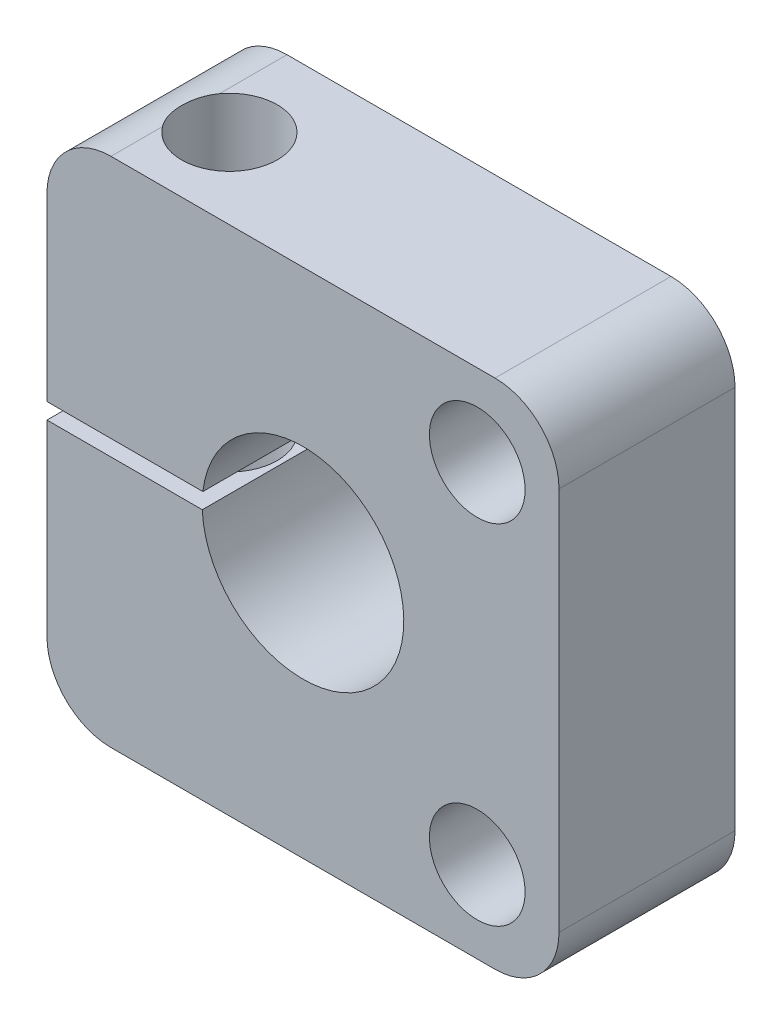
ISO-10303-21;
HEADER;
FILE_DESCRIPTION(('STEP AP214'),'2;1');
FILE_NAME('part.step','',(''),(''),'','','');
FILE_SCHEMA(('AUTOMOTIVE_DESIGN { 1 0 10303 214 1 1 1 1 }'));
ENDSEC;
DATA;
#1=APPLICATION_CONTEXT('core data for automotive mechanical design processes');
#2=APPLICATION_PROTOCOL_DEFINITION('international standard','automotive_design',2000,#1);
#3=PRODUCT_CONTEXT('',#1,'mechanical');
#4=PRODUCT('Part','Part','',(#3));
#5=PRODUCT_RELATED_PRODUCT_CATEGORY('part','',(#4));
#6=PRODUCT_DEFINITION_FORMATION('','',#4);
#7=PRODUCT_DEFINITION_CONTEXT('part definition',#1,'design');
#8=PRODUCT_DEFINITION('design','',#6,#7);
#9=PRODUCT_DEFINITION_SHAPE('','',#8);
#10=(LENGTH_UNIT() NAMED_UNIT(*) SI_UNIT(.MILLI.,.METRE.));
#11=(NAMED_UNIT(*) PLANE_ANGLE_UNIT() SI_UNIT($,.RADIAN.));
#12=(NAMED_UNIT(*) SI_UNIT($,.STERADIAN.) SOLID_ANGLE_UNIT());
#13=UNCERTAINTY_MEASURE_WITH_UNIT(LENGTH_MEASURE(1.E-05),#10,'distance_accuracy_value','');
#14=(GEOMETRIC_REPRESENTATION_CONTEXT(3) GLOBAL_UNCERTAINTY_ASSIGNED_CONTEXT((#13)) GLOBAL_UNIT_ASSIGNED_CONTEXT((#10,
#11,#12)) REPRESENTATION_CONTEXT('',''));
#15=CARTESIAN_POINT('',(0.,0.,0.));
#16=DIRECTION('',(0.,0.,1.));
#17=DIRECTION('',(1.,0.,0.));
#18=AXIS2_PLACEMENT_3D('',#15,#16,#17);
#19=CARTESIAN_POINT('',(-10.16,10.16,6.985));
#20=DIRECTION('',(1.,0.,0.));
#21=DIRECTION('',(0.,1.,0.));
#22=AXIS2_PLACEMENT_3D('',#19,#20,#21);
#23=PLANE('',#22);
#24=DIRECTION('',(0.,-1.,0.));
#25=VECTOR('',#24,1.);
#26=CARTESIAN_POINT('',(-10.16,10.16,0.));
#27=LINE('',#26,#25);
#28=CARTESIAN_POINT('',(-10.16,-0.173197844795916,0.));
#29=VERTEX_POINT('',#28);
#30=CARTESIAN_POINT('',(-10.16,-7.62,0.));
#31=VERTEX_POINT('',#30);
#32=EDGE_CURVE('E240',#29,#31,#27,.T.);
#33=ORIENTED_EDGE('',*,*,#32,.T.);
#34=DIRECTION('',(0.,0.,-1.));
#35=VECTOR('',#34,1.);
#36=CARTESIAN_POINT('',(-10.16,-7.62,6.985));
#37=LINE('',#36,#35);
#38=CARTESIAN_POINT('',(-10.16,-7.62,6.985));
#39=VERTEX_POINT('',#38);
#40=EDGE_CURVE('E173',#31,#39,#37,.F.);
#41=ORIENTED_EDGE('',*,*,#40,.T.);
#42=DIRECTION('',(0.,-1.,0.));
#43=VECTOR('',#42,1.);
#44=CARTESIAN_POINT('',(-10.16,10.16,6.985));
#45=LINE('',#44,#43);
#46=CARTESIAN_POINT('',(-10.16,-0.173197844795916,6.985));
#47=VERTEX_POINT('',#46);
#48=EDGE_CURVE('E228',#47,#39,#45,.T.);
#49=ORIENTED_EDGE('',*,*,#48,.F.);
#50=DIRECTION('',(0.,0.,-1.));
#51=VECTOR('',#50,1.);
#52=CARTESIAN_POINT('',(-10.16,-0.173197844795915,6.985));
#53=LINE('',#52,#51);
#54=EDGE_CURVE('E217',#47,#29,#53,.T.);
#55=ORIENTED_EDGE('',*,*,#54,.T.);
#56=EDGE_LOOP('',(#33,#41,#49,#55));
#57=FACE_BOUND('',#56,.T.);
#58=ADVANCED_FACE('F36',(#57),#23,.F.);
#59=CARTESIAN_POINT('',(10.16,10.16,6.985));
#60=DIRECTION('',(-1.,0.,0.));
#61=DIRECTION('',(0.,-1.,0.));
#62=AXIS2_PLACEMENT_3D('',#59,#60,#61);
#63=PLANE('',#62);
#64=DIRECTION('',(0.,1.,0.));
#65=VECTOR('',#64,1.);
#66=CARTESIAN_POINT('',(10.16,10.16,6.985));
#67=LINE('',#66,#65);
#68=CARTESIAN_POINT('',(10.16,-7.62,6.985));
#69=VERTEX_POINT('',#68);
#70=CARTESIAN_POINT('',(10.16,7.62,6.985));
#71=VERTEX_POINT('',#70);
#72=EDGE_CURVE('E221',#69,#71,#67,.T.);
#73=ORIENTED_EDGE('',*,*,#72,.F.);
#74=DIRECTION('',(0.,0.,-1.));
#75=VECTOR('',#74,1.);
#76=CARTESIAN_POINT('',(10.16,-7.62,6.985));
#77=LINE('',#76,#75);
#78=CARTESIAN_POINT('',(10.16,-7.62,0.));
#79=VERTEX_POINT('',#78);
#80=EDGE_CURVE('E247',#69,#79,#77,.T.);
#81=ORIENTED_EDGE('',*,*,#80,.T.);
#82=DIRECTION('',(0.,1.,0.));
#83=VECTOR('',#82,1.);
#84=CARTESIAN_POINT('',(10.16,10.16,0.));
#85=LINE('',#84,#83);
#86=CARTESIAN_POINT('',(10.16,7.62,0.));
#87=VERTEX_POINT('',#86);
#88=EDGE_CURVE('E220',#79,#87,#85,.T.);
#89=ORIENTED_EDGE('',*,*,#88,.T.);
#90=DIRECTION('',(0.,0.,-1.));
#91=VECTOR('',#90,1.);
#92=CARTESIAN_POINT('',(10.16,7.62,6.985));
#93=LINE('',#92,#91);
#94=EDGE_CURVE('E245',#87,#71,#93,.F.);
#95=ORIENTED_EDGE('',*,*,#94,.T.);
#96=EDGE_LOOP('',(#73,#81,#89,#95));
#97=FACE_BOUND('',#96,.T.);
#98=ADVANCED_FACE('F271',(#97),#63,.F.);
#99=CARTESIAN_POINT('',(-10.16,10.16,6.985));
#100=DIRECTION('',(0.,-1.,0.));
#101=DIRECTION('',(0.,0.,-1.));
#102=AXIS2_PLACEMENT_3D('',#99,#100,#101);
#103=PLANE('',#102);
#104=DIRECTION('',(0.,0.,-1.));
#105=VECTOR('',#104,1.);
#106=CARTESIAN_POINT('',(-7.62,10.16,6.985));
#107=LINE('',#106,#105);
#108=CARTESIAN_POINT('',(-7.62,10.16,0.));
#109=VERTEX_POINT('',#108);
#110=CARTESIAN_POINT('',(-7.62,10.16,2.67761498486603));
#111=VERTEX_POINT('',#110);
#112=EDGE_CURVE('E176',#109,#111,#107,.F.);
#113=ORIENTED_EDGE('',*,*,#112,.T.);
#114=CARTESIAN_POINT('',(-6.096,10.16,3.81));
#115=DIRECTION('',(0.,1.,0.));
#116=DIRECTION('',(0.,0.,1.));
#117=AXIS2_PLACEMENT_3D('',#114,#115,#116);
#118=CIRCLE('',#117,1.89864999999999);
#119=CARTESIAN_POINT('',(-7.62,10.16,4.94238501513397));
#120=VERTEX_POINT('',#119);
#121=EDGE_CURVE('E56',#120,#111,#118,.T.);
#122=ORIENTED_EDGE('',*,*,#121,.F.);
#123=CARTESIAN_POINT('',(-7.62,10.16,6.985));
#124=VERTEX_POINT('',#123);
#125=EDGE_CURVE('E175',#120,#124,#107,.F.);
#126=ORIENTED_EDGE('',*,*,#125,.T.);
#127=DIRECTION('',(-1.,0.,0.));
#128=VECTOR('',#127,1.);
#129=CARTESIAN_POINT('',(-10.16,10.16,6.985));
#130=LINE('',#129,#128);
#131=CARTESIAN_POINT('',(7.62,10.16,6.985));
#132=VERTEX_POINT('',#131);
#133=EDGE_CURVE('E224',#132,#124,#130,.T.);
#134=ORIENTED_EDGE('',*,*,#133,.F.);
#135=DIRECTION('',(0.,0.,-1.));
#136=VECTOR('',#135,1.);
#137=CARTESIAN_POINT('',(7.62,10.16,6.985));
#138=LINE('',#137,#136);
#139=CARTESIAN_POINT('',(7.62,10.16,0.));
#140=VERTEX_POINT('',#139);
#141=EDGE_CURVE('E179',#132,#140,#138,.T.);
#142=ORIENTED_EDGE('',*,*,#141,.T.);
#143=DIRECTION('',(-1.,0.,0.));
#144=VECTOR('',#143,1.);
#145=CARTESIAN_POINT('',(-10.16,10.16,0.));
#146=LINE('',#145,#144);
#147=EDGE_CURVE('E237',#140,#109,#146,.T.);
#148=ORIENTED_EDGE('',*,*,#147,.T.);
#149=EDGE_LOOP('',(#113,#122,#126,#134,#142,#148));
#150=FACE_BOUND('',#149,.T.);
#151=ADVANCED_FACE('F280',(#150),#103,.F.);
#152=CARTESIAN_POINT('',(-10.16,7.62,6.985));
#153=VERTEX_POINT('',#152);
#154=CARTESIAN_POINT('',(-10.16,0.461802155204082,6.985));
#155=VERTEX_POINT('',#154);
#156=EDGE_CURVE('E229',#153,#155,#45,.T.);
#157=ORIENTED_EDGE('',*,*,#156,.F.);
#158=DIRECTION('',(0.,0.,-1.));
#159=VECTOR('',#158,1.);
#160=CARTESIAN_POINT('',(-10.16,7.62,6.985));
#161=LINE('',#160,#159);
#162=CARTESIAN_POINT('',(-10.16,7.62,0.));
#163=VERTEX_POINT('',#162);
#164=EDGE_CURVE('E182',#153,#163,#161,.T.);
#165=ORIENTED_EDGE('',*,*,#164,.T.);
#166=CARTESIAN_POINT('',(-10.16,0.461802155204083,0.));
#167=VERTEX_POINT('',#166);
#168=EDGE_CURVE('E241',#163,#167,#27,.T.);
#169=ORIENTED_EDGE('',*,*,#168,.T.);
#170=DIRECTION('',(0.,0.,1.));
#171=VECTOR('',#170,1.);
#172=CARTESIAN_POINT('',(-10.16,0.461802155204083,6.985));
#173=LINE('',#172,#171);
#174=EDGE_CURVE('E203',#167,#155,#173,.T.);
#175=ORIENTED_EDGE('',*,*,#174,.T.);
#176=EDGE_LOOP('',(#157,#165,#169,#175));
#177=FACE_BOUND('',#176,.T.);
#178=ADVANCED_FACE('F288',(#177),#23,.F.);
#179=CARTESIAN_POINT('',(-10.16,-10.16,6.985));
#180=DIRECTION('',(0.,1.,0.));
#181=DIRECTION('',(0.,0.,1.));
#182=AXIS2_PLACEMENT_3D('',#179,#180,#181);
#183=PLANE('',#182);
#184=DIRECTION('',(0.,0.,-1.));
#185=VECTOR('',#184,1.);
#186=CARTESIAN_POINT('',(-7.62,-10.16,6.985));
#187=LINE('',#186,#185);
#188=CARTESIAN_POINT('',(-7.62,-10.16,6.985));
#189=VERTEX_POINT('',#188);
#190=CARTESIAN_POINT('',(-7.62,-10.16,4.94238501513398));
#191=VERTEX_POINT('',#190);
#192=EDGE_CURVE('E151',#189,#191,#187,.T.);
#193=ORIENTED_EDGE('',*,*,#192,.T.);
#194=CARTESIAN_POINT('',(-6.096,-10.16,3.81));
#195=DIRECTION('',(0.,1.,0.));
#196=DIRECTION('',(0.,0.,1.));
#197=AXIS2_PLACEMENT_3D('',#194,#195,#196);
#198=CIRCLE('',#197,1.89865);
#199=CARTESIAN_POINT('',(-7.62,-10.16,2.67761498486602));
#200=VERTEX_POINT('',#199);
#201=EDGE_CURVE('E62',#191,#200,#198,.T.);
#202=ORIENTED_EDGE('',*,*,#201,.T.);
#203=CARTESIAN_POINT('',(-7.62,-10.16,0.));
#204=VERTEX_POINT('',#203);
#205=EDGE_CURVE('E148',#200,#204,#187,.T.);
#206=ORIENTED_EDGE('',*,*,#205,.T.);
#207=DIRECTION('',(1.,0.,0.));
#208=VECTOR('',#207,1.);
#209=CARTESIAN_POINT('',(-10.16,-10.16,0.));
#210=LINE('',#209,#208);
#211=CARTESIAN_POINT('',(7.62,-10.16,0.));
#212=VERTEX_POINT('',#211);
#213=EDGE_CURVE('E225',#204,#212,#210,.T.);
#214=ORIENTED_EDGE('',*,*,#213,.T.);
#215=DIRECTION('',(0.,0.,-1.));
#216=VECTOR('',#215,1.);
#217=CARTESIAN_POINT('',(7.62,-10.16,6.985));
#218=LINE('',#217,#216);
#219=CARTESIAN_POINT('',(7.62,-10.16,6.985));
#220=VERTEX_POINT('',#219);
#221=EDGE_CURVE('E160',#212,#220,#218,.F.);
#222=ORIENTED_EDGE('',*,*,#221,.T.);
#223=DIRECTION('',(1.,0.,0.));
#224=VECTOR('',#223,1.);
#225=CARTESIAN_POINT('',(-10.16,-10.16,6.985));
#226=LINE('',#225,#224);
#227=EDGE_CURVE('E232',#189,#220,#226,.T.);
#228=ORIENTED_EDGE('',*,*,#227,.F.);
#229=EDGE_LOOP('',(#193,#202,#206,#214,#222,#228));
#230=FACE_BOUND('',#229,.T.);
#231=ADVANCED_FACE('F146',(#230),#183,.F.);
#232=CARTESIAN_POINT('',(0.,0.,6.985));
#233=DIRECTION('',(0.,0.,1.));
#234=DIRECTION('',(1.,0.,0.));
#235=AXIS2_PLACEMENT_3D('',#232,#233,#234);
#236=PLANE('',#235);
#237=CARTESIAN_POINT('',(0.,0.,6.985));
#238=DIRECTION('',(0.,0.,1.));
#239=DIRECTION('',(1.,0.,0.));
#240=AXIS2_PLACEMENT_3D('',#237,#238,#239);
#241=CIRCLE('',#240,4.);
#242=CARTESIAN_POINT('',(-3.99624855415151,-0.173197844795915,6.985));
#243=VERTEX_POINT('',#242);
#244=CARTESIAN_POINT('',(-3.9732529203977,0.461802155204082,6.985));
#245=VERTEX_POINT('',#244);
#246=EDGE_CURVE('E361',#243,#245,#241,.T.);
#247=ORIENTED_EDGE('',*,*,#246,.F.);
#248=DIRECTION('',(1.,0.,0.));
#249=VECTOR('',#248,1.);
#250=CARTESIAN_POINT('',(0.,-0.173197844795914,6.985));
#251=LINE('',#250,#249);
#252=EDGE_CURVE('E214',#47,#243,#251,.T.);
#253=ORIENTED_EDGE('',*,*,#252,.F.);
#254=ORIENTED_EDGE('',*,*,#48,.T.);
#255=CARTESIAN_POINT('',(-7.62,-7.62,6.985));
#256=DIRECTION('',(0.,0.,1.));
#257=DIRECTION('',(1.,0.,0.));
#258=AXIS2_PLACEMENT_3D('',#255,#256,#257);
#259=CIRCLE('',#258,2.54);
#260=EDGE_CURVE('E169',#39,#189,#259,.T.);
#261=ORIENTED_EDGE('',*,*,#260,.T.);
#262=ORIENTED_EDGE('',*,*,#227,.T.);
#263=CARTESIAN_POINT('',(7.62,-7.62,6.985));
#264=DIRECTION('',(0.,0.,1.));
#265=DIRECTION('',(1.,0.,0.));
#266=AXIS2_PLACEMENT_3D('',#263,#264,#265);
#267=CIRCLE('',#266,2.54);
#268=EDGE_CURVE('E171',#220,#69,#267,.T.);
#269=ORIENTED_EDGE('',*,*,#268,.T.);
#270=ORIENTED_EDGE('',*,*,#72,.T.);
#271=CARTESIAN_POINT('',(7.62,7.62,6.985));
#272=DIRECTION('',(0.,0.,1.));
#273=DIRECTION('',(1.,0.,0.));
#274=AXIS2_PLACEMENT_3D('',#271,#272,#273);
#275=CIRCLE('',#274,2.54);
#276=EDGE_CURVE('E167',#71,#132,#275,.T.);
#277=ORIENTED_EDGE('',*,*,#276,.T.);
#278=ORIENTED_EDGE('',*,*,#133,.T.);
#279=CARTESIAN_POINT('',(-7.62,7.62,6.985));
#280=DIRECTION('',(0.,0.,1.));
#281=DIRECTION('',(1.,0.,0.));
#282=AXIS2_PLACEMENT_3D('',#279,#280,#281);
#283=CIRCLE('',#282,2.54);
#284=EDGE_CURVE('E165',#124,#153,#283,.T.);
#285=ORIENTED_EDGE('',*,*,#284,.T.);
#286=ORIENTED_EDGE('',*,*,#156,.T.);
#287=DIRECTION('',(-1.,0.,0.));
#288=VECTOR('',#287,1.);
#289=CARTESIAN_POINT('',(0.,0.461802155204082,6.985));
#290=LINE('',#289,#288);
#291=EDGE_CURVE('E204',#245,#155,#290,.T.);
#292=ORIENTED_EDGE('',*,*,#291,.F.);
#293=EDGE_LOOP('',(#247,#253,#254,#261,#262,#269,#270,#277,#278,#285,#286,#292));
#294=FACE_BOUND('',#293,.T.);
#295=CARTESIAN_POINT('',(6.91479721322325,6.91479721322364,6.985));
#296=DIRECTION('',(0.,0.,1.));
#297=DIRECTION('',(1.,0.,0.));
#298=AXIS2_PLACEMENT_3D('',#295,#296,#297);
#299=CIRCLE('',#298,1.89865);
#300=CARTESIAN_POINT('',(8.81344721322325,6.91479721322364,6.985));
#301=VERTEX_POINT('',#300);
#302=EDGE_CURVE('E353',#301,#301,#299,.T.);
#303=ORIENTED_EDGE('',*,*,#302,.F.);
#304=EDGE_LOOP('',(#303));
#305=FACE_BOUND('',#304,.T.);
#306=CARTESIAN_POINT('',(6.91479721322364,-6.91479721322286,6.985));
#307=DIRECTION('',(0.,0.,1.));
#308=DIRECTION('',(1.,0.,0.));
#309=AXIS2_PLACEMENT_3D('',#306,#307,#308);
#310=CIRCLE('',#309,1.89865);
#311=CARTESIAN_POINT('',(8.81344721322364,-6.91479721322286,6.985));
#312=VERTEX_POINT('',#311);
#313=EDGE_CURVE('E209',#312,#312,#310,.T.);
#314=ORIENTED_EDGE('',*,*,#313,.F.);
#315=EDGE_LOOP('',(#314));
#316=FACE_BOUND('',#315,.T.);
#317=ADVANCED_FACE('F260',(#294,#305,#316),#236,.T.);
#318=CARTESIAN_POINT('',(0.,0.,0.));
#319=DIRECTION('',(0.,0.,1.));
#320=DIRECTION('',(1.,0.,0.));
#321=AXIS2_PLACEMENT_3D('',#318,#319,#320);
#322=PLANE('',#321);
#323=CARTESIAN_POINT('',(6.91479721322325,6.91479721322364,0.));
#324=DIRECTION('',(0.,0.,1.));
#325=DIRECTION('',(1.,0.,0.));
#326=AXIS2_PLACEMENT_3D('',#323,#324,#325);
#327=CIRCLE('',#326,1.89865);
#328=CARTESIAN_POINT('',(8.81344721322325,6.91479721322364,0.));
#329=VERTEX_POINT('',#328);
#330=EDGE_CURVE('E347',#329,#329,#327,.T.);
#331=ORIENTED_EDGE('',*,*,#330,.T.);
#332=EDGE_LOOP('',(#331));
#333=FACE_BOUND('',#332,.T.);
#334=CARTESIAN_POINT('',(6.91479721322364,-6.91479721322286,0.));
#335=DIRECTION('',(0.,0.,1.));
#336=DIRECTION('',(1.,0.,0.));
#337=AXIS2_PLACEMENT_3D('',#334,#335,#336);
#338=CIRCLE('',#337,1.89865);
#339=CARTESIAN_POINT('',(8.81344721322364,-6.91479721322286,0.));
#340=VERTEX_POINT('',#339);
#341=EDGE_CURVE('E205',#340,#340,#338,.T.);
#342=ORIENTED_EDGE('',*,*,#341,.T.);
#343=EDGE_LOOP('',(#342));
#344=FACE_BOUND('',#343,.T.);
#345=DIRECTION('',(1.,0.,0.));
#346=VECTOR('',#345,1.);
#347=CARTESIAN_POINT('',(0.,-0.173197844795914,0.));
#348=LINE('',#347,#346);
#349=CARTESIAN_POINT('',(-3.99624855415151,-0.173197844795915,0.));
#350=VERTEX_POINT('',#349);
#351=EDGE_CURVE('E193',#29,#350,#348,.T.);
#352=ORIENTED_EDGE('',*,*,#351,.T.);
#353=CARTESIAN_POINT('',(0.,0.,0.));
#354=DIRECTION('',(0.,0.,1.));
#355=DIRECTION('',(1.,0.,0.));
#356=AXIS2_PLACEMENT_3D('',#353,#354,#355);
#357=CIRCLE('',#356,4.);
#358=CARTESIAN_POINT('',(-3.9732529203977,0.461802155204082,0.));
#359=VERTEX_POINT('',#358);
#360=EDGE_CURVE('E50',#350,#359,#357,.T.);
#361=ORIENTED_EDGE('',*,*,#360,.T.);
#362=DIRECTION('',(-1.,0.,0.));
#363=VECTOR('',#362,1.);
#364=CARTESIAN_POINT('',(-3.70742984825034,0.461802155204082,0.));
#365=LINE('',#364,#363);
#366=EDGE_CURVE('E190',#359,#167,#365,.T.);
#367=ORIENTED_EDGE('',*,*,#366,.T.);
#368=ORIENTED_EDGE('',*,*,#168,.F.);
#369=CARTESIAN_POINT('',(-7.62,7.62,0.));
#370=DIRECTION('',(0.,0.,1.));
#371=DIRECTION('',(1.,0.,0.));
#372=AXIS2_PLACEMENT_3D('',#369,#370,#371);
#373=CIRCLE('',#372,2.54);
#374=EDGE_CURVE('E250',#163,#109,#373,.F.);
#375=ORIENTED_EDGE('',*,*,#374,.T.);
#376=ORIENTED_EDGE('',*,*,#147,.F.);
#377=CARTESIAN_POINT('',(7.62,7.62,0.));
#378=DIRECTION('',(0.,0.,1.));
#379=DIRECTION('',(1.,0.,0.));
#380=AXIS2_PLACEMENT_3D('',#377,#378,#379);
#381=CIRCLE('',#380,2.54);
#382=EDGE_CURVE('E252',#140,#87,#381,.F.);
#383=ORIENTED_EDGE('',*,*,#382,.T.);
#384=ORIENTED_EDGE('',*,*,#88,.F.);
#385=CARTESIAN_POINT('',(7.62,-7.62,0.));
#386=DIRECTION('',(0.,0.,1.));
#387=DIRECTION('',(1.,0.,0.));
#388=AXIS2_PLACEMENT_3D('',#385,#386,#387);
#389=CIRCLE('',#388,2.54);
#390=EDGE_CURVE('E158',#79,#212,#389,.F.);
#391=ORIENTED_EDGE('',*,*,#390,.T.);
#392=ORIENTED_EDGE('',*,*,#213,.F.);
#393=CARTESIAN_POINT('',(-7.62,-7.62,0.));
#394=DIRECTION('',(0.,0.,1.));
#395=DIRECTION('',(1.,0.,0.));
#396=AXIS2_PLACEMENT_3D('',#393,#394,#395);
#397=CIRCLE('',#396,2.54);
#398=EDGE_CURVE('E156',#204,#31,#397,.F.);
#399=ORIENTED_EDGE('',*,*,#398,.T.);
#400=ORIENTED_EDGE('',*,*,#32,.F.);
#401=EDGE_LOOP('',(#352,#361,#367,#368,#375,#376,#383,#384,#391,#392,#399,#400));
#402=FACE_BOUND('',#401,.T.);
#403=ADVANCED_FACE('F188',(#333,#344,#402),#322,.F.);
#404=CARTESIAN_POINT('',(-3.70742984825034,-0.173197844795915,0.));
#405=DIRECTION('',(0.,-1.,0.));
#406=DIRECTION('',(1.,0.,0.));
#407=AXIS2_PLACEMENT_3D('',#404,#405,#406);
#408=PLANE('',#407);
#409=CARTESIAN_POINT('',(-6.096,-0.173197844795915,3.81));
#410=DIRECTION('',(0.,-1.,0.));
#411=DIRECTION('',(1.,0.,0.));
#412=AXIS2_PLACEMENT_3D('',#409,#410,#411);
#413=CIRCLE('',#412,1.89864999999999);
#414=CARTESIAN_POINT('',(-4.19735000000001,-0.173197844795915,3.81));
#415=VERTEX_POINT('',#414);
#416=EDGE_CURVE('E366',#415,#415,#413,.T.);
#417=ORIENTED_EDGE('',*,*,#416,.T.);
#418=EDGE_LOOP('',(#417));
#419=FACE_BOUND('',#418,.T.);
#420=ORIENTED_EDGE('',*,*,#252,.T.);
#421=DIRECTION('',(0.,0.,1.));
#422=VECTOR('',#421,1.);
#423=CARTESIAN_POINT('',(-3.99624855415151,-0.173197844795915,6.985));
#424=LINE('',#423,#422);
#425=EDGE_CURVE('E358',#243,#350,#424,.F.);
#426=ORIENTED_EDGE('',*,*,#425,.T.);
#427=ORIENTED_EDGE('',*,*,#351,.F.);
#428=ORIENTED_EDGE('',*,*,#54,.F.);
#429=EDGE_LOOP('',(#420,#426,#427,#428));
#430=FACE_BOUND('',#429,.T.);
#431=ADVANCED_FACE('F331',(#419,#430),#408,.F.);
#432=CARTESIAN_POINT('',(-3.70742984825034,0.461802155204082,0.));
#433=DIRECTION('',(0.,1.,0.));
#434=DIRECTION('',(0.,0.,1.));
#435=AXIS2_PLACEMENT_3D('',#432,#433,#434);
#436=PLANE('',#435);
#437=CARTESIAN_POINT('',(-6.096,0.461802155204083,3.81));
#438=DIRECTION('',(0.,1.,0.));
#439=DIRECTION('',(0.,0.,1.));
#440=AXIS2_PLACEMENT_3D('',#437,#438,#439);
#441=CIRCLE('',#440,1.89864999999999);
#442=CARTESIAN_POINT('',(-6.096,0.461802155204083,5.70864999999999));
#443=VERTEX_POINT('',#442);
#444=EDGE_CURVE('E363',#443,#443,#441,.T.);
#445=ORIENTED_EDGE('',*,*,#444,.T.);
#446=EDGE_LOOP('',(#445));
#447=FACE_BOUND('',#446,.T.);
#448=ORIENTED_EDGE('',*,*,#366,.F.);
#449=DIRECTION('',(0.,0.,1.));
#450=VECTOR('',#449,1.);
#451=CARTESIAN_POINT('',(-3.9732529203977,0.461802155204082,6.985));
#452=LINE('',#451,#450);
#453=EDGE_CURVE('E200',#359,#245,#452,.T.);
#454=ORIENTED_EDGE('',*,*,#453,.T.);
#455=ORIENTED_EDGE('',*,*,#291,.T.);
#456=ORIENTED_EDGE('',*,*,#174,.F.);
#457=EDGE_LOOP('',(#448,#454,#455,#456));
#458=FACE_BOUND('',#457,.T.);
#459=ADVANCED_FACE('F199',(#447,#458),#436,.F.);
#460=CARTESIAN_POINT('',(6.91479721322364,-6.91479721322286,6.985));
#461=DIRECTION('',(0.,0.,1.));
#462=DIRECTION('',(1.,0.,0.));
#463=AXIS2_PLACEMENT_3D('',#460,#461,#462);
#464=CYLINDRICAL_SURFACE('',#463,1.89865);
#465=ORIENTED_EDGE('',*,*,#341,.F.);
#466=EDGE_LOOP('',(#465));
#467=FACE_BOUND('',#466,.T.);
#468=ORIENTED_EDGE('',*,*,#313,.T.);
#469=EDGE_LOOP('',(#468));
#470=FACE_BOUND('',#469,.T.);
#471=ADVANCED_FACE('F326',(#467,#470),#464,.F.);
#472=CARTESIAN_POINT('',(6.91479721322325,6.91479721322364,6.985));
#473=DIRECTION('',(0.,0.,1.));
#474=DIRECTION('',(1.,0.,0.));
#475=AXIS2_PLACEMENT_3D('',#472,#473,#474);
#476=CYLINDRICAL_SURFACE('',#475,1.89865);
#477=ORIENTED_EDGE('',*,*,#330,.F.);
#478=EDGE_LOOP('',(#477));
#479=FACE_BOUND('',#478,.T.);
#480=ORIENTED_EDGE('',*,*,#302,.T.);
#481=EDGE_LOOP('',(#480));
#482=FACE_BOUND('',#481,.T.);
#483=ADVANCED_FACE('F306',(#479,#482),#476,.F.);
#484=CARTESIAN_POINT('',(7.62,-7.62,6.985));
#485=DIRECTION('',(0.,0.,-1.));
#486=DIRECTION('',(-1.,0.,0.));
#487=AXIS2_PLACEMENT_3D('',#484,#485,#486);
#488=CYLINDRICAL_SURFACE('',#487,2.54);
#489=ORIENTED_EDGE('',*,*,#268,.F.);
#490=ORIENTED_EDGE('',*,*,#221,.F.);
#491=ORIENTED_EDGE('',*,*,#390,.F.);
#492=ORIENTED_EDGE('',*,*,#80,.F.);
#493=EDGE_LOOP('',(#489,#490,#491,#492));
#494=FACE_BOUND('',#493,.T.);
#495=ADVANCED_FACE('F266',(#494),#488,.T.);
#496=CARTESIAN_POINT('',(-7.62,-7.62,6.985));
#497=DIRECTION('',(0.,0.,-1.));
#498=DIRECTION('',(-1.,0.,0.));
#499=AXIS2_PLACEMENT_3D('',#496,#497,#498);
#500=CYLINDRICAL_SURFACE('',#499,2.54);
#501=CARTESIAN_POINT('',(-7.62,-10.16,4.94238501513398));
#502=CARTESIAN_POINT('',(-7.65178519417828,-10.15999669612,4.8996074421857));
#503=CARTESIAN_POINT('',(-7.68174904201368,-10.1594040314018,4.85551683941508));
#504=CARTESIAN_POINT('',(-7.73785640669738,-10.1574199645449,4.76499568408178));
#505=CARTESIAN_POINT('',(-7.76400062816151,-10.1560287099581,4.71856556522609));
#506=CARTESIAN_POINT('',(-7.83640795484012,-10.1512294550934,4.5762612106196));
#507=CARTESIAN_POINT('',(-7.87670714875926,-10.1471945043304,4.4772901163397));
#508=CARTESIAN_POINT('',(-7.94016129025954,-10.1399455578576,4.2739994554758));
#509=CARTESIAN_POINT('',(-7.96331312304341,-10.1367317113699,4.16967892085051));
#510=CARTESIAN_POINT('',(-7.99181205449334,-10.1326813731404,3.95862827397729));
#511=CARTESIAN_POINT('',(-7.99716991142915,-10.1318434449589,3.85189965697737));
#512=CARTESIAN_POINT('',(-7.98995161216849,-10.1329161949667,3.63949225678355));
#513=CARTESIAN_POINT('',(-7.97744498223358,-10.1348162176605,3.5338110066857));
#514=CARTESIAN_POINT('',(-7.93498940535461,-10.1404823821593,3.32602107940645));
#515=CARTESIAN_POINT('',(-7.90503554289458,-10.1442490498209,3.22391341763175));
#516=CARTESIAN_POINT('',(-7.83596232735234,-10.1509915385615,3.04533766527337));
#517=CARTESIAN_POINT('',(-7.79974244102131,-10.1539792143242,2.96773440615529));
#518=CARTESIAN_POINT('',(-7.71724384190173,-10.1584638580907,2.81815723947548));
#519=CARTESIAN_POINT('',(-7.67097753391676,-10.159962651878,2.74617653719554));
#520=CARTESIAN_POINT('',(-7.62,-10.16,2.67761498486602));
#521=B_SPLINE_CURVE_WITH_KNOTS('',3,(#501,#502,#503,#504,#505,#506,#507,#508,#509,#510,#511,
#512,#513,#514,#515,#516,#517,#518,#519,#520),.UNSPECIFIED.,.F.,.F.,(4,2,2,2,2,2,2,2,2,4),(0.,
0.159770550778621,0.319511590976324,0.638688177774654,0.957922728401582,1.27696423407477,
1.59476744948359,1.91266024488215,2.16897335522114,2.42497176494889),.UNSPECIFIED.);
#522=EDGE_CURVE('E11',#191,#200,#521,.T.);
#523=ORIENTED_EDGE('',*,*,#522,.F.);
#524=ORIENTED_EDGE('',*,*,#192,.F.);
#525=ORIENTED_EDGE('',*,*,#260,.F.);
#526=ORIENTED_EDGE('',*,*,#40,.F.);
#527=ORIENTED_EDGE('',*,*,#398,.F.);
#528=ORIENTED_EDGE('',*,*,#205,.F.);
#529=EDGE_LOOP('',(#523,#524,#525,#526,#527,#528));
#530=FACE_BOUND('',#529,.T.);
#531=ADVANCED_FACE('F154',(#530),#500,.T.);
#532=CARTESIAN_POINT('',(7.62,7.62,6.985));
#533=DIRECTION('',(0.,0.,-1.));
#534=DIRECTION('',(-1.,0.,0.));
#535=AXIS2_PLACEMENT_3D('',#532,#533,#534);
#536=CYLINDRICAL_SURFACE('',#535,2.54);
#537=ORIENTED_EDGE('',*,*,#276,.F.);
#538=ORIENTED_EDGE('',*,*,#94,.F.);
#539=ORIENTED_EDGE('',*,*,#382,.F.);
#540=ORIENTED_EDGE('',*,*,#141,.F.);
#541=EDGE_LOOP('',(#537,#538,#539,#540));
#542=FACE_BOUND('',#541,.T.);
#543=ADVANCED_FACE('F275',(#542),#536,.T.);
#544=CARTESIAN_POINT('',(-7.62,7.62,6.985));
#545=DIRECTION('',(0.,0.,-1.));
#546=DIRECTION('',(-1.,0.,0.));
#547=AXIS2_PLACEMENT_3D('',#544,#545,#546);
#548=CYLINDRICAL_SURFACE('',#547,2.54);
#549=CARTESIAN_POINT('',(-7.62,10.16,2.67761498486603));
#550=CARTESIAN_POINT('',(-7.65178519417828,10.15999669612,2.72039255781431));
#551=CARTESIAN_POINT('',(-7.68174904201368,10.1594040314018,2.76448316058492));
#552=CARTESIAN_POINT('',(-7.73785640669738,10.1574199645449,2.85500431591822));
#553=CARTESIAN_POINT('',(-7.76400062816151,10.1560287099581,2.90143443477391));
#554=CARTESIAN_POINT('',(-7.83640795484012,10.1512294550934,3.04373878938041));
#555=CARTESIAN_POINT('',(-7.87670714875926,10.1471945043304,3.1427098836603));
#556=CARTESIAN_POINT('',(-7.94016129025954,10.1399455578576,3.3460005445242));
#557=CARTESIAN_POINT('',(-7.96331312304341,10.1367317113699,3.4503210791495));
#558=CARTESIAN_POINT('',(-7.99181205449334,10.1326813731404,3.66137172602272));
#559=CARTESIAN_POINT('',(-7.99716991142915,10.131843444959,3.76810034302264));
#560=CARTESIAN_POINT('',(-7.98995161216849,10.1329161949667,3.98050774321645));
#561=CARTESIAN_POINT('',(-7.97744498223358,10.1348162176605,4.08618899331431));
#562=CARTESIAN_POINT('',(-7.93498940535461,10.1404823821593,4.29397892059355));
#563=CARTESIAN_POINT('',(-7.90503554289458,10.1442490498209,4.39608658236825));
#564=CARTESIAN_POINT('',(-7.83596232735234,10.1509915385615,4.57466233472663));
#565=CARTESIAN_POINT('',(-7.79974244102131,10.1539792143242,4.65226559384471));
#566=CARTESIAN_POINT('',(-7.71724384190173,10.1584638580907,4.80184276052452));
#567=CARTESIAN_POINT('',(-7.67097753391676,10.159962651878,4.87382346280446));
#568=CARTESIAN_POINT('',(-7.62,10.16,4.94238501513397));
#569=B_SPLINE_CURVE_WITH_KNOTS('',3,(#549,#550,#551,#552,#553,#554,#555,#556,#557,#558,#559,
#560,#561,#562,#563,#564,#565,#566,#567,#568),.UNSPECIFIED.,.F.,.F.,(4,2,2,2,2,2,2,2,2,4),(0.,
0.159770550778622,0.319511590976325,0.638688177774654,0.957922728401582,1.27696423407477,
1.59476744948359,1.91266024488215,2.16897335522114,2.42497176494888),.UNSPECIFIED.);
#570=EDGE_CURVE('E152',#111,#120,#569,.T.);
#571=ORIENTED_EDGE('',*,*,#570,.F.);
#572=ORIENTED_EDGE('',*,*,#112,.F.);
#573=ORIENTED_EDGE('',*,*,#374,.F.);
#574=ORIENTED_EDGE('',*,*,#164,.F.);
#575=ORIENTED_EDGE('',*,*,#284,.F.);
#576=ORIENTED_EDGE('',*,*,#125,.F.);
#577=EDGE_LOOP('',(#571,#572,#573,#574,#575,#576));
#578=FACE_BOUND('',#577,.T.);
#579=ADVANCED_FACE('F38',(#578),#548,.T.);
#580=CARTESIAN_POINT('',(0.,0.,6.985));
#581=DIRECTION('',(0.,0.,1.));
#582=DIRECTION('',(1.,0.,0.));
#583=AXIS2_PLACEMENT_3D('',#580,#581,#582);
#584=CYLINDRICAL_SURFACE('',#583,4.);
#585=ORIENTED_EDGE('',*,*,#246,.T.);
#586=ORIENTED_EDGE('',*,*,#453,.F.);
#587=ORIENTED_EDGE('',*,*,#360,.F.);
#588=ORIENTED_EDGE('',*,*,#425,.F.);
#589=EDGE_LOOP('',(#585,#586,#587,#588));
#590=FACE_BOUND('',#589,.T.);
#591=ADVANCED_FACE('F313',(#590),#584,.F.);
#592=CARTESIAN_POINT('',(-6.096,10.16,3.81));
#593=DIRECTION('',(0.,1.,0.));
#594=DIRECTION('',(0.,0.,1.));
#595=AXIS2_PLACEMENT_3D('',#592,#593,#594);
#596=CYLINDRICAL_SURFACE('',#595,1.89864999999999);
#597=ORIENTED_EDGE('',*,*,#522,.T.);
#598=ORIENTED_EDGE('',*,*,#201,.F.);
#599=EDGE_LOOP('',(#597,#598));
#600=FACE_BOUND('',#599,.T.);
#601=ORIENTED_EDGE('',*,*,#416,.F.);
#602=EDGE_LOOP('',(#601));
#603=FACE_BOUND('',#602,.T.);
#604=ADVANCED_FACE('F139',(#600,#603),#596,.F.);
#605=ORIENTED_EDGE('',*,*,#570,.T.);
#606=ORIENTED_EDGE('',*,*,#121,.T.);
#607=EDGE_LOOP('',(#605,#606));
#608=FACE_BOUND('',#607,.T.);
#609=ORIENTED_EDGE('',*,*,#444,.F.);
#610=EDGE_LOOP('',(#609));
#611=FACE_BOUND('',#610,.T.);
#612=ADVANCED_FACE('F321',(#608,#611),#596,.F.);
#613=CLOSED_SHELL('',(#58,#98,#151,#178,#231,#317,#403,#431,#459,#471,#483,#495,#531,#543,#579,
#591,#604,#612));
#614=MANIFOLD_SOLID_BREP('B2',#613);
#615=ADVANCED_BREP_SHAPE_REPRESENTATION('',(#18,#614),#14);
#616=SHAPE_DEFINITION_REPRESENTATION(#9,#615);
ENDSEC;
END-ISO-10303-21;
